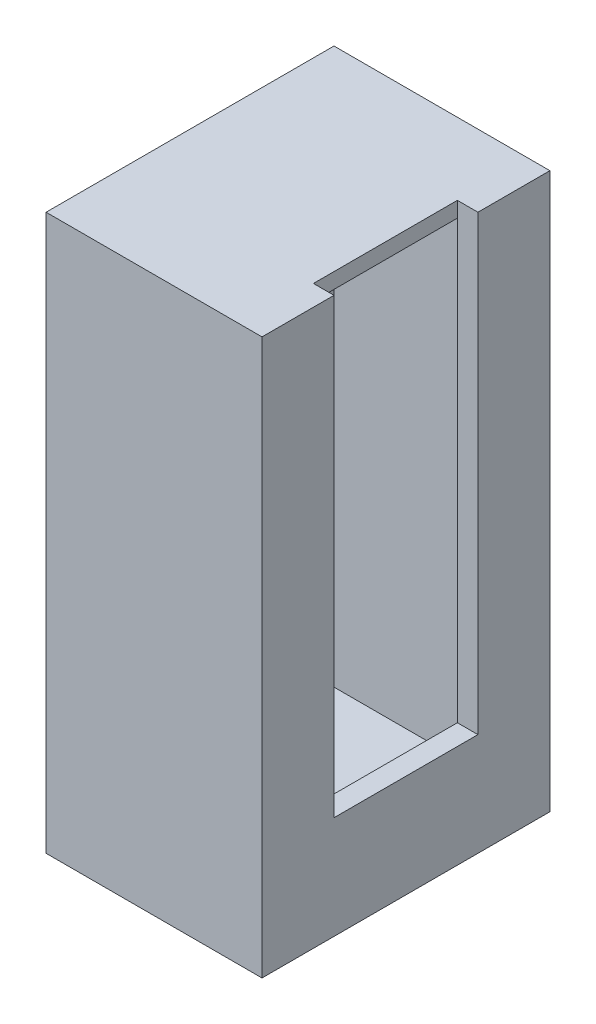
ISO-10303-21;
HEADER;
FILE_DESCRIPTION(('STEP AP214'),'2;1');
FILE_NAME('part.step','',(''),(''),'','','');
FILE_SCHEMA(('AUTOMOTIVE_DESIGN { 1 0 10303 214 1 1 1 1 }'));
ENDSEC;
DATA;
#1=APPLICATION_CONTEXT('core data for automotive mechanical design processes');
#2=APPLICATION_PROTOCOL_DEFINITION('international standard','automotive_design',2000,#1);
#3=PRODUCT_CONTEXT('',#1,'mechanical');
#4=PRODUCT('Part','Part','',(#3));
#5=PRODUCT_RELATED_PRODUCT_CATEGORY('part','',(#4));
#6=PRODUCT_DEFINITION_FORMATION('','',#4);
#7=PRODUCT_DEFINITION_CONTEXT('part definition',#1,'design');
#8=PRODUCT_DEFINITION('design','',#6,#7);
#9=PRODUCT_DEFINITION_SHAPE('','',#8);
#10=(LENGTH_UNIT() NAMED_UNIT(*) SI_UNIT(.MILLI.,.METRE.));
#11=(NAMED_UNIT(*) PLANE_ANGLE_UNIT() SI_UNIT($,.RADIAN.));
#12=(NAMED_UNIT(*) SI_UNIT($,.STERADIAN.) SOLID_ANGLE_UNIT());
#13=UNCERTAINTY_MEASURE_WITH_UNIT(LENGTH_MEASURE(1.E-05),#10,'distance_accuracy_value','');
#14=(GEOMETRIC_REPRESENTATION_CONTEXT(3) GLOBAL_UNCERTAINTY_ASSIGNED_CONTEXT((#13)) GLOBAL_UNIT_ASSIGNED_CONTEXT((#10,
#11,#12)) REPRESENTATION_CONTEXT('',''));
#15=CARTESIAN_POINT('',(0.,0.,0.));
#16=DIRECTION('',(0.,0.,1.));
#17=DIRECTION('',(1.,0.,0.));
#18=AXIS2_PLACEMENT_3D('',#15,#16,#17);
#19=CARTESIAN_POINT('',(133.35,342.9,177.8));
#20=DIRECTION('',(0.,-1.,0.));
#21=DIRECTION('',(0.,0.,-1.));
#22=AXIS2_PLACEMENT_3D('',#19,#20,#21);
#23=PLANE('',#22);
#24=DIRECTION('',(0.,0.,-1.));
#25=VECTOR('',#24,1.);
#26=CARTESIAN_POINT('',(133.35,342.9,177.8));
#27=LINE('',#26,#25);
#28=CARTESIAN_POINT('',(133.35,342.9,177.8));
#29=VERTEX_POINT('',#28);
#30=CARTESIAN_POINT('',(133.35,342.9,88.9000000000001));
#31=VERTEX_POINT('',#30);
#32=EDGE_CURVE('E326',#29,#31,#27,.T.);
#33=ORIENTED_EDGE('',*,*,#32,.T.);
#34=DIRECTION('',(1.,0.,0.));
#35=VECTOR('',#34,1.);
#36=CARTESIAN_POINT('',(107.95,342.9,88.9000000000001));
#37=LINE('',#36,#35);
#38=CARTESIAN_POINT('',(107.95,342.9,88.9000000000001));
#39=VERTEX_POINT('',#38);
#40=EDGE_CURVE('E285',#39,#31,#37,.T.);
#41=ORIENTED_EDGE('',*,*,#40,.F.);
#42=DIRECTION('',(0.,0.,1.));
#43=VECTOR('',#42,1.);
#44=CARTESIAN_POINT('',(107.95,342.9,88.9000000000001));
#45=LINE('',#44,#43);
#46=CARTESIAN_POINT('',(107.95,342.9,-88.9000000000001));
#47=VERTEX_POINT('',#46);
#48=EDGE_CURVE('E271',#47,#39,#45,.T.);
#49=ORIENTED_EDGE('',*,*,#48,.F.);
#50=DIRECTION('',(1.,0.,0.));
#51=VECTOR('',#50,1.);
#52=CARTESIAN_POINT('',(107.95,342.9,-88.9000000000001));
#53=LINE('',#52,#51);
#54=CARTESIAN_POINT('',(133.35,342.9,-88.9000000000001));
#55=VERTEX_POINT('',#54);
#56=EDGE_CURVE('E289',#47,#55,#53,.T.);
#57=ORIENTED_EDGE('',*,*,#56,.T.);
#58=CARTESIAN_POINT('',(133.35,342.9,-177.8));
#59=VERTEX_POINT('',#58);
#60=EDGE_CURVE('E312',#55,#59,#27,.T.);
#61=ORIENTED_EDGE('',*,*,#60,.T.);
#62=DIRECTION('',(-1.,0.,0.));
#63=VECTOR('',#62,1.);
#64=CARTESIAN_POINT('',(133.35,342.9,-177.8));
#65=LINE('',#64,#63);
#66=CARTESIAN_POINT('',(-133.35,342.9,-177.8));
#67=VERTEX_POINT('',#66);
#68=EDGE_CURVE('E288',#59,#67,#65,.T.);
#69=ORIENTED_EDGE('',*,*,#68,.T.);
#70=DIRECTION('',(0.,0.,-1.));
#71=VECTOR('',#70,1.);
#72=CARTESIAN_POINT('',(-133.35,342.9,177.8));
#73=LINE('',#72,#71);
#74=CARTESIAN_POINT('',(-133.35,342.9,177.8));
#75=VERTEX_POINT('',#74);
#76=EDGE_CURVE('E45',#75,#67,#73,.T.);
#77=ORIENTED_EDGE('',*,*,#76,.F.);
#78=DIRECTION('',(-1.,0.,0.));
#79=VECTOR('',#78,1.);
#80=CARTESIAN_POINT('',(133.35,342.9,177.8));
#81=LINE('',#80,#79);
#82=EDGE_CURVE('E298',#29,#75,#81,.T.);
#83=ORIENTED_EDGE('',*,*,#82,.F.);
#84=EDGE_LOOP('',(#33,#41,#49,#57,#61,#69,#77,#83));
#85=FACE_BOUND('',#84,.T.);
#86=ADVANCED_FACE('F42',(#85),#23,.F.);
#87=CARTESIAN_POINT('',(-133.35,342.9,177.8));
#88=DIRECTION('',(1.,0.,0.));
#89=DIRECTION('',(0.,0.,-1.));
#90=AXIS2_PLACEMENT_3D('',#87,#88,#89);
#91=PLANE('',#90);
#92=DIRECTION('',(0.,-1.,0.));
#93=VECTOR('',#92,1.);
#94=CARTESIAN_POINT('',(-133.35,342.9,-177.8));
#95=LINE('',#94,#93);
#96=CARTESIAN_POINT('',(-133.35,-342.9,-177.8));
#97=VERTEX_POINT('',#96);
#98=EDGE_CURVE('E316',#67,#97,#95,.T.);
#99=ORIENTED_EDGE('',*,*,#98,.T.);
#100=DIRECTION('',(0.,0.,-1.));
#101=VECTOR('',#100,1.);
#102=CARTESIAN_POINT('',(-133.35,-342.9,177.8));
#103=LINE('',#102,#101);
#104=CARTESIAN_POINT('',(-133.35,-342.9,177.8));
#105=VERTEX_POINT('',#104);
#106=EDGE_CURVE('E333',#105,#97,#103,.T.);
#107=ORIENTED_EDGE('',*,*,#106,.F.);
#108=DIRECTION('',(0.,-1.,0.));
#109=VECTOR('',#108,1.);
#110=CARTESIAN_POINT('',(-133.35,342.9,177.8));
#111=LINE('',#110,#109);
#112=EDGE_CURVE('E302',#75,#105,#111,.T.);
#113=ORIENTED_EDGE('',*,*,#112,.F.);
#114=ORIENTED_EDGE('',*,*,#76,.T.);
#115=EDGE_LOOP('',(#99,#107,#113,#114));
#116=FACE_BOUND('',#115,.T.);
#117=ADVANCED_FACE('F344',(#116),#91,.F.);
#118=CARTESIAN_POINT('',(-133.35,-342.9,177.8));
#119=DIRECTION('',(0.,1.,0.));
#120=DIRECTION('',(0.,0.,1.));
#121=AXIS2_PLACEMENT_3D('',#118,#119,#120);
#122=PLANE('',#121);
#123=DIRECTION('',(1.,0.,0.));
#124=VECTOR('',#123,1.);
#125=CARTESIAN_POINT('',(-133.35,-342.9,-177.8));
#126=LINE('',#125,#124);
#127=CARTESIAN_POINT('',(133.35,-342.9,-177.8));
#128=VERTEX_POINT('',#127);
#129=EDGE_CURVE('E319',#97,#128,#126,.T.);
#130=ORIENTED_EDGE('',*,*,#129,.T.);
#131=DIRECTION('',(0.,0.,-1.));
#132=VECTOR('',#131,1.);
#133=CARTESIAN_POINT('',(133.35,-342.9,177.8));
#134=LINE('',#133,#132);
#135=CARTESIAN_POINT('',(133.35,-342.9,177.8));
#136=VERTEX_POINT('',#135);
#137=EDGE_CURVE('E330',#136,#128,#134,.T.);
#138=ORIENTED_EDGE('',*,*,#137,.F.);
#139=DIRECTION('',(1.,0.,0.));
#140=VECTOR('',#139,1.);
#141=CARTESIAN_POINT('',(-133.35,-342.9,177.8));
#142=LINE('',#141,#140);
#143=EDGE_CURVE('E306',#105,#136,#142,.T.);
#144=ORIENTED_EDGE('',*,*,#143,.F.);
#145=ORIENTED_EDGE('',*,*,#106,.T.);
#146=EDGE_LOOP('',(#130,#138,#144,#145));
#147=FACE_BOUND('',#146,.T.);
#148=ADVANCED_FACE('F352',(#147),#122,.F.);
#149=CARTESIAN_POINT('',(133.35,0.,177.8));
#150=DIRECTION('',(-1.,0.,0.));
#151=DIRECTION('',(0.,-1.,0.));
#152=AXIS2_PLACEMENT_3D('',#149,#150,#151);
#153=PLANE('',#152);
#154=DIRECTION('',(0.,0.,-1.));
#155=VECTOR('',#154,1.);
#156=CARTESIAN_POINT('',(133.35,-215.9,88.9));
#157=LINE('',#156,#155);
#158=CARTESIAN_POINT('',(133.35,-215.9,88.9));
#159=VERTEX_POINT('',#158);
#160=CARTESIAN_POINT('',(133.35,-215.9,-88.9));
#161=VERTEX_POINT('',#160);
#162=EDGE_CURVE('E278',#159,#161,#157,.T.);
#163=ORIENTED_EDGE('',*,*,#162,.F.);
#164=DIRECTION('',(0.,-1.,0.));
#165=VECTOR('',#164,1.);
#166=CARTESIAN_POINT('',(133.35,342.9,88.9000000000001));
#167=LINE('',#166,#165);
#168=EDGE_CURVE('E66',#31,#159,#167,.T.);
#169=ORIENTED_EDGE('',*,*,#168,.F.);
#170=ORIENTED_EDGE('',*,*,#32,.F.);
#171=DIRECTION('',(0.,1.,0.));
#172=VECTOR('',#171,1.);
#173=CARTESIAN_POINT('',(133.35,-342.9,177.8));
#174=LINE('',#173,#172);
#175=EDGE_CURVE('E309',#136,#29,#174,.T.);
#176=ORIENTED_EDGE('',*,*,#175,.F.);
#177=ORIENTED_EDGE('',*,*,#137,.T.);
#178=DIRECTION('',(0.,1.,0.));
#179=VECTOR('',#178,1.);
#180=CARTESIAN_POINT('',(133.35,0.,-177.8));
#181=LINE('',#180,#179);
#182=EDGE_CURVE('E303',#128,#59,#181,.T.);
#183=ORIENTED_EDGE('',*,*,#182,.T.);
#184=ORIENTED_EDGE('',*,*,#60,.F.);
#185=DIRECTION('',(0.,1.,0.));
#186=VECTOR('',#185,1.);
#187=CARTESIAN_POINT('',(133.35,342.9,-88.9000000000001));
#188=LINE('',#187,#186);
#189=EDGE_CURVE('E282',#161,#55,#188,.T.);
#190=ORIENTED_EDGE('',*,*,#189,.F.);
#191=EDGE_LOOP('',(#163,#169,#170,#176,#177,#183,#184,#190));
#192=FACE_BOUND('',#191,.T.);
#193=ADVANCED_FACE('F356',(#192),#153,.F.);
#194=CARTESIAN_POINT('',(0.,0.,177.8));
#195=DIRECTION('',(0.,0.,1.));
#196=DIRECTION('',(1.,0.,0.));
#197=AXIS2_PLACEMENT_3D('',#194,#195,#196);
#198=PLANE('',#197);
#199=ORIENTED_EDGE('',*,*,#82,.T.);
#200=ORIENTED_EDGE('',*,*,#112,.T.);
#201=ORIENTED_EDGE('',*,*,#143,.T.);
#202=ORIENTED_EDGE('',*,*,#175,.T.);
#203=EDGE_LOOP('',(#199,#200,#201,#202));
#204=FACE_BOUND('',#203,.T.);
#205=ADVANCED_FACE('F359',(#204),#198,.T.);
#206=CARTESIAN_POINT('',(0.,0.,-177.8));
#207=DIRECTION('',(0.,0.,1.));
#208=DIRECTION('',(1.,0.,0.));
#209=AXIS2_PLACEMENT_3D('',#206,#207,#208);
#210=PLANE('',#209);
#211=ORIENTED_EDGE('',*,*,#68,.F.);
#212=ORIENTED_EDGE('',*,*,#182,.F.);
#213=ORIENTED_EDGE('',*,*,#129,.F.);
#214=ORIENTED_EDGE('',*,*,#98,.F.);
#215=EDGE_LOOP('',(#211,#212,#213,#214));
#216=FACE_BOUND('',#215,.T.);
#217=ADVANCED_FACE('F350',(#216),#210,.F.);
#218=CARTESIAN_POINT('',(107.95,342.9,88.9000000000001));
#219=DIRECTION('',(0.,0.,1.));
#220=DIRECTION('',(0.,-1.,0.));
#221=AXIS2_PLACEMENT_3D('',#218,#219,#220);
#222=PLANE('',#221);
#223=ORIENTED_EDGE('',*,*,#168,.T.);
#224=DIRECTION('',(1.,0.,0.));
#225=VECTOR('',#224,1.);
#226=CARTESIAN_POINT('',(107.95,-215.9,88.9));
#227=LINE('',#226,#225);
#228=CARTESIAN_POINT('',(107.95,-215.9,88.9));
#229=VERTEX_POINT('',#228);
#230=EDGE_CURVE('E275',#229,#159,#227,.T.);
#231=ORIENTED_EDGE('',*,*,#230,.F.);
#232=DIRECTION('',(0.,-1.,0.));
#233=VECTOR('',#232,1.);
#234=CARTESIAN_POINT('',(107.95,342.9,88.9000000000001));
#235=LINE('',#234,#233);
#236=CARTESIAN_POINT('',(107.95,323.85,88.9));
#237=VERTEX_POINT('',#236);
#238=EDGE_CURVE('E264',#237,#229,#235,.T.);
#239=ORIENTED_EDGE('',*,*,#238,.F.);
#240=EDGE_CURVE('E259',#39,#237,#235,.T.);
#241=ORIENTED_EDGE('',*,*,#240,.F.);
#242=ORIENTED_EDGE('',*,*,#40,.T.);
#243=EDGE_LOOP('',(#223,#231,#239,#241,#242));
#244=FACE_BOUND('',#243,.T.);
#245=ADVANCED_FACE('F362',(#244),#222,.F.);
#246=CARTESIAN_POINT('',(107.95,342.9,-88.9000000000001));
#247=DIRECTION('',(0.,0.,-1.));
#248=DIRECTION('',(0.,1.,0.));
#249=AXIS2_PLACEMENT_3D('',#246,#247,#248);
#250=PLANE('',#249);
#251=ORIENTED_EDGE('',*,*,#189,.T.);
#252=ORIENTED_EDGE('',*,*,#56,.F.);
#253=DIRECTION('',(0.,1.,0.));
#254=VECTOR('',#253,1.);
#255=CARTESIAN_POINT('',(107.95,342.9,-88.9000000000001));
#256=LINE('',#255,#254);
#257=CARTESIAN_POINT('',(107.95,323.85,-88.9000000000001));
#258=VERTEX_POINT('',#257);
#259=EDGE_CURVE('E267',#258,#47,#256,.T.);
#260=ORIENTED_EDGE('',*,*,#259,.F.);
#261=CARTESIAN_POINT('',(107.95,-215.9,-88.9));
#262=VERTEX_POINT('',#261);
#263=EDGE_CURVE('E268',#262,#258,#256,.T.);
#264=ORIENTED_EDGE('',*,*,#263,.F.);
#265=DIRECTION('',(1.,0.,0.));
#266=VECTOR('',#265,1.);
#267=CARTESIAN_POINT('',(107.95,-215.9,-88.9));
#268=LINE('',#267,#266);
#269=EDGE_CURVE('E293',#262,#161,#268,.T.);
#270=ORIENTED_EDGE('',*,*,#269,.T.);
#271=EDGE_LOOP('',(#251,#252,#260,#264,#270));
#272=FACE_BOUND('',#271,.T.);
#273=ADVANCED_FACE('F379',(#272),#250,.F.);
#274=CARTESIAN_POINT('',(107.95,-215.9,88.9));
#275=DIRECTION('',(0.,-1.,0.));
#276=DIRECTION('',(1.,0.,0.));
#277=AXIS2_PLACEMENT_3D('',#274,#275,#276);
#278=PLANE('',#277);
#279=ORIENTED_EDGE('',*,*,#162,.T.);
#280=ORIENTED_EDGE('',*,*,#269,.F.);
#281=DIRECTION('',(0.,0.,-1.));
#282=VECTOR('',#281,1.);
#283=CARTESIAN_POINT('',(107.95,-215.9,88.9));
#284=LINE('',#283,#282);
#285=EDGE_CURVE('E263',#229,#262,#284,.T.);
#286=ORIENTED_EDGE('',*,*,#285,.F.);
#287=ORIENTED_EDGE('',*,*,#230,.T.);
#288=EDGE_LOOP('',(#279,#280,#286,#287));
#289=FACE_BOUND('',#288,.T.);
#290=ADVANCED_FACE('F367',(#289),#278,.F.);
#291=CARTESIAN_POINT('',(107.95,0.,0.));
#292=DIRECTION('',(1.,0.,0.));
#293=DIRECTION('',(0.,1.,0.));
#294=AXIS2_PLACEMENT_3D('',#291,#292,#293);
#295=PLANE('',#294);
#296=DIRECTION('',(0.,0.,1.));
#297=VECTOR('',#296,1.);
#298=CARTESIAN_POINT('',(107.95,323.85,177.8));
#299=LINE('',#298,#297);
#300=EDGE_CURVE('E11',#258,#237,#299,.T.);
#301=ORIENTED_EDGE('',*,*,#300,.F.);
#302=ORIENTED_EDGE('',*,*,#259,.T.);
#303=ORIENTED_EDGE('',*,*,#48,.T.);
#304=ORIENTED_EDGE('',*,*,#240,.T.);
#305=EDGE_LOOP('',(#301,#302,#303,#304));
#306=FACE_BOUND('',#305,.T.);
#307=ADVANCED_FACE('F374',(#306),#295,.T.);
#308=CARTESIAN_POINT('',(133.35,323.85,177.8));
#309=DIRECTION('',(0.,-1.,0.));
#310=DIRECTION('',(0.,0.,-1.));
#311=AXIS2_PLACEMENT_3D('',#308,#309,#310);
#312=PLANE('',#311);
#313=DIRECTION('',(0.,0.,-1.));
#314=VECTOR('',#313,1.);
#315=CARTESIAN_POINT('',(114.3,323.85,177.8));
#316=LINE('',#315,#314);
#317=CARTESIAN_POINT('',(114.3,323.85,158.75));
#318=VERTEX_POINT('',#317);
#319=CARTESIAN_POINT('',(114.3,323.85,107.95));
#320=VERTEX_POINT('',#319);
#321=EDGE_CURVE('E168',#318,#320,#316,.T.);
#322=ORIENTED_EDGE('',*,*,#321,.F.);
#323=DIRECTION('',(-1.,0.,0.));
#324=VECTOR('',#323,1.);
#325=CARTESIAN_POINT('',(133.35,323.85,158.75));
#326=LINE('',#325,#324);
#327=CARTESIAN_POINT('',(-114.3,323.85,158.75));
#328=VERTEX_POINT('',#327);
#329=EDGE_CURVE('E214',#318,#328,#326,.T.);
#330=ORIENTED_EDGE('',*,*,#329,.T.);
#331=DIRECTION('',(0.,0.,-1.));
#332=VECTOR('',#331,1.);
#333=CARTESIAN_POINT('',(-114.3,323.85,177.8));
#334=LINE('',#333,#332);
#335=CARTESIAN_POINT('',(-114.3,323.85,-158.75));
#336=VERTEX_POINT('',#335);
#337=EDGE_CURVE('E210',#328,#336,#334,.T.);
#338=ORIENTED_EDGE('',*,*,#337,.T.);
#339=DIRECTION('',(-1.,0.,0.));
#340=VECTOR('',#339,1.);
#341=CARTESIAN_POINT('',(133.35,323.85,-158.75));
#342=LINE('',#341,#340);
#343=CARTESIAN_POINT('',(114.3,323.85,-158.75));
#344=VERTEX_POINT('',#343);
#345=EDGE_CURVE('E174',#344,#336,#342,.T.);
#346=ORIENTED_EDGE('',*,*,#345,.F.);
#347=DIRECTION('',(0.,0.,-1.));
#348=VECTOR('',#347,1.);
#349=CARTESIAN_POINT('',(114.3,323.85,177.8));
#350=LINE('',#349,#348);
#351=CARTESIAN_POINT('',(114.3,323.85,-107.95));
#352=VERTEX_POINT('',#351);
#353=EDGE_CURVE('E193',#352,#344,#350,.T.);
#354=ORIENTED_EDGE('',*,*,#353,.F.);
#355=DIRECTION('',(1.,0.,0.));
#356=VECTOR('',#355,1.);
#357=CARTESIAN_POINT('',(133.35,323.85,-107.95));
#358=LINE('',#357,#356);
#359=CARTESIAN_POINT('',(107.95,323.85,-107.95));
#360=VERTEX_POINT('',#359);
#361=EDGE_CURVE('E175',#360,#352,#358,.T.);
#362=ORIENTED_EDGE('',*,*,#361,.F.);
#363=EDGE_CURVE('E52',#360,#258,#299,.T.);
#364=ORIENTED_EDGE('',*,*,#363,.T.);
#365=ORIENTED_EDGE('',*,*,#300,.T.);
#366=CARTESIAN_POINT('',(107.95,323.85,107.95));
#367=VERTEX_POINT('',#366);
#368=EDGE_CURVE('E53',#237,#367,#299,.T.);
#369=ORIENTED_EDGE('',*,*,#368,.T.);
#370=DIRECTION('',(1.,0.,0.));
#371=VECTOR('',#370,1.);
#372=CARTESIAN_POINT('',(107.95,323.85,107.95));
#373=LINE('',#372,#371);
#374=EDGE_CURVE('E163',#367,#320,#373,.T.);
#375=ORIENTED_EDGE('',*,*,#374,.T.);
#376=EDGE_LOOP('',(#322,#330,#338,#346,#354,#362,#364,#365,#369,#375));
#377=FACE_BOUND('',#376,.T.);
#378=ADVANCED_FACE('F165',(#377),#312,.T.);
#379=CARTESIAN_POINT('',(-114.3,342.9,177.8));
#380=DIRECTION('',(1.,0.,0.));
#381=DIRECTION('',(0.,0.,-1.));
#382=AXIS2_PLACEMENT_3D('',#379,#380,#381);
#383=PLANE('',#382);
#384=DIRECTION('',(0.,-1.,0.));
#385=VECTOR('',#384,1.);
#386=CARTESIAN_POINT('',(-114.3,342.9,-158.75));
#387=LINE('',#386,#385);
#388=CARTESIAN_POINT('',(-114.3,-323.85,-158.75));
#389=VERTEX_POINT('',#388);
#390=EDGE_CURVE('E209',#336,#389,#387,.T.);
#391=ORIENTED_EDGE('',*,*,#390,.F.);
#392=ORIENTED_EDGE('',*,*,#337,.F.);
#393=DIRECTION('',(0.,-1.,0.));
#394=VECTOR('',#393,1.);
#395=CARTESIAN_POINT('',(-114.3,342.9,158.75));
#396=LINE('',#395,#394);
#397=CARTESIAN_POINT('',(-114.3,-323.85,158.75));
#398=VERTEX_POINT('',#397);
#399=EDGE_CURVE('E217',#328,#398,#396,.T.);
#400=ORIENTED_EDGE('',*,*,#399,.T.);
#401=DIRECTION('',(0.,0.,-1.));
#402=VECTOR('',#401,1.);
#403=CARTESIAN_POINT('',(-114.3,-323.85,177.8));
#404=LINE('',#403,#402);
#405=EDGE_CURVE('E198',#398,#389,#404,.T.);
#406=ORIENTED_EDGE('',*,*,#405,.T.);
#407=EDGE_LOOP('',(#391,#392,#400,#406));
#408=FACE_BOUND('',#407,.T.);
#409=ADVANCED_FACE('F402',(#408),#383,.T.);
#410=CARTESIAN_POINT('',(-133.35,-323.85,177.8));
#411=DIRECTION('',(0.,1.,0.));
#412=DIRECTION('',(0.,0.,1.));
#413=AXIS2_PLACEMENT_3D('',#410,#411,#412);
#414=PLANE('',#413);
#415=DIRECTION('',(1.,0.,0.));
#416=VECTOR('',#415,1.);
#417=CARTESIAN_POINT('',(-133.35,-323.85,-158.75));
#418=LINE('',#417,#416);
#419=CARTESIAN_POINT('',(114.3,-323.85,-158.75));
#420=VERTEX_POINT('',#419);
#421=EDGE_CURVE('E221',#389,#420,#418,.T.);
#422=ORIENTED_EDGE('',*,*,#421,.F.);
#423=ORIENTED_EDGE('',*,*,#405,.F.);
#424=DIRECTION('',(1.,0.,0.));
#425=VECTOR('',#424,1.);
#426=CARTESIAN_POINT('',(-133.35,-323.85,158.75));
#427=LINE('',#426,#425);
#428=CARTESIAN_POINT('',(114.3,-323.85,158.75));
#429=VERTEX_POINT('',#428);
#430=EDGE_CURVE('E227',#398,#429,#427,.T.);
#431=ORIENTED_EDGE('',*,*,#430,.T.);
#432=DIRECTION('',(0.,0.,-1.));
#433=VECTOR('',#432,1.);
#434=CARTESIAN_POINT('',(114.3,-323.85,177.8));
#435=LINE('',#434,#433);
#436=EDGE_CURVE('E192',#429,#420,#435,.T.);
#437=ORIENTED_EDGE('',*,*,#436,.T.);
#438=EDGE_LOOP('',(#422,#423,#431,#437));
#439=FACE_BOUND('',#438,.T.);
#440=ADVANCED_FACE('F396',(#439),#414,.T.);
#441=CARTESIAN_POINT('',(114.3,0.,177.8));
#442=DIRECTION('',(-1.,0.,0.));
#443=DIRECTION('',(0.,-1.,0.));
#444=AXIS2_PLACEMENT_3D('',#441,#442,#443);
#445=PLANE('',#444);
#446=DIRECTION('',(0.,0.,-1.));
#447=VECTOR('',#446,1.);
#448=CARTESIAN_POINT('',(114.3,-234.95,88.9));
#449=LINE('',#448,#447);
#450=CARTESIAN_POINT('',(114.3,-234.95,107.95));
#451=VERTEX_POINT('',#450);
#452=CARTESIAN_POINT('',(114.3,-234.95,-107.95));
#453=VERTEX_POINT('',#452);
#454=EDGE_CURVE('E185',#451,#453,#449,.T.);
#455=ORIENTED_EDGE('',*,*,#454,.T.);
#456=DIRECTION('',(0.,1.,0.));
#457=VECTOR('',#456,1.);
#458=CARTESIAN_POINT('',(114.3,342.9,-107.95));
#459=LINE('',#458,#457);
#460=EDGE_CURVE('E234',#453,#352,#459,.T.);
#461=ORIENTED_EDGE('',*,*,#460,.T.);
#462=ORIENTED_EDGE('',*,*,#353,.T.);
#463=DIRECTION('',(0.,1.,0.));
#464=VECTOR('',#463,1.);
#465=CARTESIAN_POINT('',(114.3,0.,-158.75));
#466=LINE('',#465,#464);
#467=EDGE_CURVE('E218',#420,#344,#466,.T.);
#468=ORIENTED_EDGE('',*,*,#467,.F.);
#469=ORIENTED_EDGE('',*,*,#436,.F.);
#470=DIRECTION('',(0.,1.,0.));
#471=VECTOR('',#470,1.);
#472=CARTESIAN_POINT('',(114.3,0.,158.75));
#473=LINE('',#472,#471);
#474=EDGE_CURVE('E190',#429,#318,#473,.T.);
#475=ORIENTED_EDGE('',*,*,#474,.T.);
#476=ORIENTED_EDGE('',*,*,#321,.T.);
#477=DIRECTION('',(0.,-1.,0.));
#478=VECTOR('',#477,1.);
#479=CARTESIAN_POINT('',(114.3,342.9,107.95));
#480=LINE('',#479,#478);
#481=EDGE_CURVE('E178',#320,#451,#480,.T.);
#482=ORIENTED_EDGE('',*,*,#481,.T.);
#483=EDGE_LOOP('',(#455,#461,#462,#468,#469,#475,#476,#482));
#484=FACE_BOUND('',#483,.T.);
#485=ADVANCED_FACE('F187',(#484),#445,.T.);
#486=CARTESIAN_POINT('',(0.,0.,158.75));
#487=DIRECTION('',(0.,0.,1.));
#488=DIRECTION('',(1.,0.,0.));
#489=AXIS2_PLACEMENT_3D('',#486,#487,#488);
#490=PLANE('',#489);
#491=ORIENTED_EDGE('',*,*,#329,.F.);
#492=ORIENTED_EDGE('',*,*,#474,.F.);
#493=ORIENTED_EDGE('',*,*,#430,.F.);
#494=ORIENTED_EDGE('',*,*,#399,.F.);
#495=EDGE_LOOP('',(#491,#492,#493,#494));
#496=FACE_BOUND('',#495,.T.);
#497=ADVANCED_FACE('F399',(#496),#490,.F.);
#498=CARTESIAN_POINT('',(0.,0.,-158.75));
#499=DIRECTION('',(0.,0.,1.));
#500=DIRECTION('',(1.,0.,0.));
#501=AXIS2_PLACEMENT_3D('',#498,#499,#500);
#502=PLANE('',#501);
#503=ORIENTED_EDGE('',*,*,#345,.T.);
#504=ORIENTED_EDGE('',*,*,#390,.T.);
#505=ORIENTED_EDGE('',*,*,#421,.T.);
#506=ORIENTED_EDGE('',*,*,#467,.T.);
#507=EDGE_LOOP('',(#503,#504,#505,#506));
#508=FACE_BOUND('',#507,.T.);
#509=ADVANCED_FACE('F392',(#508),#502,.T.);
#510=CARTESIAN_POINT('',(107.95,342.9,107.95));
#511=DIRECTION('',(0.,0.,1.));
#512=DIRECTION('',(0.,-1.,0.));
#513=AXIS2_PLACEMENT_3D('',#510,#511,#512);
#514=PLANE('',#513);
#515=ORIENTED_EDGE('',*,*,#481,.F.);
#516=ORIENTED_EDGE('',*,*,#374,.F.);
#517=DIRECTION('',(0.,-1.,0.));
#518=VECTOR('',#517,1.);
#519=CARTESIAN_POINT('',(107.95,0.,107.95));
#520=LINE('',#519,#518);
#521=CARTESIAN_POINT('',(107.95,-234.95,107.95));
#522=VERTEX_POINT('',#521);
#523=EDGE_CURVE('E243',#367,#522,#520,.T.);
#524=ORIENTED_EDGE('',*,*,#523,.T.);
#525=DIRECTION('',(1.,0.,0.));
#526=VECTOR('',#525,1.);
#527=CARTESIAN_POINT('',(107.95,-234.95,107.95));
#528=LINE('',#527,#526);
#529=EDGE_CURVE('E180',#522,#451,#528,.T.);
#530=ORIENTED_EDGE('',*,*,#529,.T.);
#531=EDGE_LOOP('',(#515,#516,#524,#530));
#532=FACE_BOUND('',#531,.T.);
#533=ADVANCED_FACE('F179',(#532),#514,.T.);
#534=CARTESIAN_POINT('',(107.95,342.9,-107.95));
#535=DIRECTION('',(0.,0.,-1.));
#536=DIRECTION('',(0.,1.,0.));
#537=AXIS2_PLACEMENT_3D('',#534,#535,#536);
#538=PLANE('',#537);
#539=ORIENTED_EDGE('',*,*,#460,.F.);
#540=DIRECTION('',(1.,0.,0.));
#541=VECTOR('',#540,1.);
#542=CARTESIAN_POINT('',(107.95,-234.95,-107.95));
#543=LINE('',#542,#541);
#544=CARTESIAN_POINT('',(107.95,-234.95,-107.95));
#545=VERTEX_POINT('',#544);
#546=EDGE_CURVE('E204',#545,#453,#543,.T.);
#547=ORIENTED_EDGE('',*,*,#546,.F.);
#548=DIRECTION('',(0.,1.,0.));
#549=VECTOR('',#548,1.);
#550=CARTESIAN_POINT('',(107.95,0.,-107.95));
#551=LINE('',#550,#549);
#552=EDGE_CURVE('E255',#545,#360,#551,.T.);
#553=ORIENTED_EDGE('',*,*,#552,.T.);
#554=ORIENTED_EDGE('',*,*,#361,.T.);
#555=EDGE_LOOP('',(#539,#547,#553,#554));
#556=FACE_BOUND('',#555,.T.);
#557=ADVANCED_FACE('F388',(#556),#538,.T.);
#558=CARTESIAN_POINT('',(107.95,-234.95,88.9));
#559=DIRECTION('',(0.,-1.,0.));
#560=DIRECTION('',(1.,0.,0.));
#561=AXIS2_PLACEMENT_3D('',#558,#559,#560);
#562=PLANE('',#561);
#563=ORIENTED_EDGE('',*,*,#454,.F.);
#564=ORIENTED_EDGE('',*,*,#529,.F.);
#565=DIRECTION('',(0.,0.,-1.));
#566=VECTOR('',#565,1.);
#567=CARTESIAN_POINT('',(107.95,-234.95,0.));
#568=LINE('',#567,#566);
#569=EDGE_CURVE('E251',#522,#545,#568,.T.);
#570=ORIENTED_EDGE('',*,*,#569,.T.);
#571=ORIENTED_EDGE('',*,*,#546,.T.);
#572=EDGE_LOOP('',(#563,#564,#570,#571));
#573=FACE_BOUND('',#572,.T.);
#574=ADVANCED_FACE('F386',(#573),#562,.T.);
#575=CARTESIAN_POINT('',(107.95,0.,0.));
#576=DIRECTION('',(1.,0.,0.));
#577=DIRECTION('',(0.,1.,0.));
#578=AXIS2_PLACEMENT_3D('',#575,#576,#577);
#579=PLANE('',#578);
#580=ORIENTED_EDGE('',*,*,#238,.T.);
#581=ORIENTED_EDGE('',*,*,#285,.T.);
#582=ORIENTED_EDGE('',*,*,#263,.T.);
#583=ORIENTED_EDGE('',*,*,#363,.F.);
#584=ORIENTED_EDGE('',*,*,#552,.F.);
#585=ORIENTED_EDGE('',*,*,#569,.F.);
#586=ORIENTED_EDGE('',*,*,#523,.F.);
#587=ORIENTED_EDGE('',*,*,#368,.F.);
#588=EDGE_LOOP('',(#580,#581,#582,#583,#584,#585,#586,#587));
#589=FACE_BOUND('',#588,.T.);
#590=ADVANCED_FACE('F381',(#589),#579,.F.);
#591=CLOSED_SHELL('',(#86,#117,#148,#193,#205,#217,#245,#273,#290,#307,#378,#409,#440,#485,#497,
#509,#533,#557,#574,#590));
#592=MANIFOLD_SOLID_BREP('B2',#591);
#593=ADVANCED_BREP_SHAPE_REPRESENTATION('',(#18,#592),#14);
#594=SHAPE_DEFINITION_REPRESENTATION(#9,#593);
ENDSEC;
END-ISO-10303-21;
